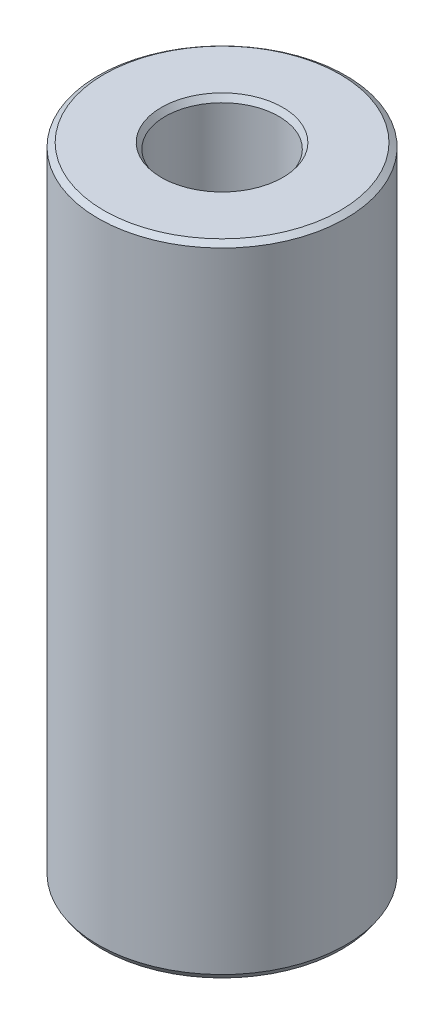
ISO-10303-21;
HEADER;
FILE_DESCRIPTION(('STEP AP214'),'2;1');
FILE_NAME('part.step','',(''),(''),'','','');
FILE_SCHEMA(('AUTOMOTIVE_DESIGN { 1 0 10303 214 1 1 1 1 }'));
ENDSEC;
DATA;
#1=APPLICATION_CONTEXT('core data for automotive mechanical design processes');
#2=APPLICATION_PROTOCOL_DEFINITION('international standard','automotive_design',2000,#1);
#3=PRODUCT_CONTEXT('',#1,'mechanical');
#4=PRODUCT('Part','Part','',(#3));
#5=PRODUCT_RELATED_PRODUCT_CATEGORY('part','',(#4));
#6=PRODUCT_DEFINITION_FORMATION('','',#4);
#7=PRODUCT_DEFINITION_CONTEXT('part definition',#1,'design');
#8=PRODUCT_DEFINITION('design','',#6,#7);
#9=PRODUCT_DEFINITION_SHAPE('','',#8);
#10=(LENGTH_UNIT() NAMED_UNIT(*) SI_UNIT(.MILLI.,.METRE.));
#11=(NAMED_UNIT(*) PLANE_ANGLE_UNIT() SI_UNIT($,.RADIAN.));
#12=(NAMED_UNIT(*) SI_UNIT($,.STERADIAN.) SOLID_ANGLE_UNIT());
#13=UNCERTAINTY_MEASURE_WITH_UNIT(LENGTH_MEASURE(1.E-05),#10,'distance_accuracy_value','');
#14=(GEOMETRIC_REPRESENTATION_CONTEXT(3) GLOBAL_UNCERTAINTY_ASSIGNED_CONTEXT((#13)) GLOBAL_UNIT_ASSIGNED_CONTEXT((#10,
#11,#12)) REPRESENTATION_CONTEXT('',''));
#15=CARTESIAN_POINT('',(0.,0.,0.));
#16=DIRECTION('',(0.,0.,1.));
#17=DIRECTION('',(1.,0.,0.));
#18=AXIS2_PLACEMENT_3D('',#15,#16,#17);
#19=CARTESIAN_POINT('',(0.,258.032303413777,0.));
#20=DIRECTION('',(0.,-1.,0.));
#21=DIRECTION('',(0.,0.,-1.));
#22=AXIS2_PLACEMENT_3D('',#19,#20,#21);
#23=CYLINDRICAL_SURFACE('',#22,50.);
#24=CARTESIAN_POINT('',(0.,2.32242210803651,0.));
#25=DIRECTION('',(0.,1.,0.));
#26=DIRECTION('',(0.,0.,1.));
#27=AXIS2_PLACEMENT_3D('',#24,#25,#26);
#28=CIRCLE('',#27,50.);
#29=CARTESIAN_POINT('',(0.,2.32242210803651,50.));
#30=VERTEX_POINT('',#29);
#31=EDGE_CURVE('E10',#30,#30,#28,.T.);
#32=ORIENTED_EDGE('',*,*,#31,.T.);
#33=EDGE_LOOP('',(#32));
#34=FACE_BOUND('',#33,.T.);
#35=CARTESIAN_POINT('',(0.,256.437061708535,0.));
#36=DIRECTION('',(0.,1.,0.));
#37=DIRECTION('',(0.,0.,1.));
#38=AXIS2_PLACEMENT_3D('',#35,#36,#37);
#39=CIRCLE('',#38,50.);
#40=CARTESIAN_POINT('',(0.,256.437061708535,50.));
#41=VERTEX_POINT('',#40);
#42=EDGE_CURVE('E50',#41,#41,#39,.F.);
#43=ORIENTED_EDGE('',*,*,#42,.T.);
#44=EDGE_LOOP('',(#43));
#45=FACE_BOUND('',#44,.T.);
#46=ADVANCED_FACE('F39',(#34,#45),#23,.T.);
#47=CARTESIAN_POINT('',(0.,258.032303413777,0.));
#48=DIRECTION('',(0.,1.,0.));
#49=DIRECTION('',(0.,0.,1.));
#50=AXIS2_PLACEMENT_3D('',#47,#48,#49);
#51=PLANE('',#50);
#52=CARTESIAN_POINT('',(0.,258.032303413777,0.));
#53=DIRECTION('',(0.,1.,0.));
#54=DIRECTION('',(0.,0.,1.));
#55=AXIS2_PLACEMENT_3D('',#52,#53,#54);
#56=CIRCLE('',#55,24.5317904876431);
#57=CARTESIAN_POINT('',(0.,258.032303413777,24.5317904876431));
#58=VERTEX_POINT('',#57);
#59=EDGE_CURVE('E58',#58,#58,#56,.F.);
#60=ORIENTED_EDGE('',*,*,#59,.T.);
#61=EDGE_LOOP('',(#60));
#62=FACE_BOUND('',#61,.T.);
#63=CARTESIAN_POINT('',(0.,258.032303413777,0.));
#64=DIRECTION('',(0.,1.,0.));
#65=DIRECTION('',(0.,0.,1.));
#66=AXIS2_PLACEMENT_3D('',#63,#64,#65);
#67=CIRCLE('',#66,47.6775778919636);
#68=CARTESIAN_POINT('',(0.,258.032303413777,47.6775778919636));
#69=VERTEX_POINT('',#68);
#70=EDGE_CURVE('E61',#69,#69,#67,.T.);
#71=ORIENTED_EDGE('',*,*,#70,.T.);
#72=EDGE_LOOP('',(#71));
#73=FACE_BOUND('',#72,.T.);
#74=ADVANCED_FACE('F88',(#62,#73),#51,.T.);
#75=CARTESIAN_POINT('',(0.,0.,0.));
#76=DIRECTION('',(0.,1.,0.));
#77=DIRECTION('',(0.,0.,1.));
#78=AXIS2_PLACEMENT_3D('',#75,#76,#77);
#79=PLANE('',#78);
#80=CARTESIAN_POINT('',(0.,0.,0.));
#81=DIRECTION('',(0.,1.,0.));
#82=DIRECTION('',(0.,0.,1.));
#83=AXIS2_PLACEMENT_3D('',#80,#81,#82);
#84=CIRCLE('',#83,25.2589708904378);
#85=CARTESIAN_POINT('',(0.,0.,25.2589708904378));
#86=VERTEX_POINT('',#85);
#87=EDGE_CURVE('E51',#86,#86,#84,.T.);
#88=ORIENTED_EDGE('',*,*,#87,.T.);
#89=EDGE_LOOP('',(#88));
#90=FACE_BOUND('',#89,.T.);
#91=CARTESIAN_POINT('',(0.,0.,0.));
#92=DIRECTION('',(0.,1.,0.));
#93=DIRECTION('',(0.,0.,1.));
#94=AXIS2_PLACEMENT_3D('',#91,#92,#93);
#95=CIRCLE('',#94,48.4047582947582);
#96=CARTESIAN_POINT('',(0.,0.,48.4047582947582));
#97=VERTEX_POINT('',#96);
#98=EDGE_CURVE('E54',#97,#97,#95,.F.);
#99=ORIENTED_EDGE('',*,*,#98,.T.);
#100=EDGE_LOOP('',(#99));
#101=FACE_BOUND('',#100,.T.);
#102=ADVANCED_FACE('F83',(#90,#101),#79,.F.);
#103=CARTESIAN_POINT('',(0.,258.032303413777,0.));
#104=DIRECTION('',(0.,-1.,0.));
#105=DIRECTION('',(0.,0.,-1.));
#106=AXIS2_PLACEMENT_3D('',#103,#104,#105);
#107=CYLINDRICAL_SURFACE('',#106,22.9365487824013);
#108=CARTESIAN_POINT('',(0.,255.70988130574,0.));
#109=DIRECTION('',(0.,1.,0.));
#110=DIRECTION('',(0.,0.,1.));
#111=AXIS2_PLACEMENT_3D('',#108,#109,#110);
#112=CIRCLE('',#111,22.9365487824013);
#113=CARTESIAN_POINT('',(0.,255.70988130574,22.9365487824013));
#114=VERTEX_POINT('',#113);
#115=EDGE_CURVE('E67',#114,#114,#112,.T.);
#116=ORIENTED_EDGE('',*,*,#115,.T.);
#117=EDGE_LOOP('',(#116));
#118=FACE_BOUND('',#117,.T.);
#119=CARTESIAN_POINT('',(0.,1.59524170524172,0.));
#120=DIRECTION('',(0.,1.,0.));
#121=DIRECTION('',(0.,0.,1.));
#122=AXIS2_PLACEMENT_3D('',#119,#120,#121);
#123=CIRCLE('',#122,22.9365487824013);
#124=CARTESIAN_POINT('',(0.,1.59524170524172,22.9365487824013));
#125=VERTEX_POINT('',#124);
#126=EDGE_CURVE('E69',#125,#125,#123,.F.);
#127=ORIENTED_EDGE('',*,*,#126,.T.);
#128=EDGE_LOOP('',(#127));
#129=FACE_BOUND('',#128,.T.);
#130=ADVANCED_FACE('F71',(#118,#129),#107,.F.);
#131=CARTESIAN_POINT('',(0.,255.70988130574,0.));
#132=DIRECTION('',(0.,1.,0.));
#133=DIRECTION('',(0.,0.,1.));
#134=AXIS2_PLACEMENT_3D('',#131,#132,#133);
#135=CONICAL_SURFACE('',#134,22.9365487824013,0.60187101645473);
#136=CARTESIAN_POINT('',(0.,258.032303413777,24.5317904876431));
#137=CARTESIAN_POINT('',(0.,258.008111516818,24.5151733865468));
#138=CARTESIAN_POINT('',(0.,257.983919619859,24.4985562854506));
#139=CARTESIAN_POINT('',(0.,257.935535825942,24.465322083258));
#140=CARTESIAN_POINT('',(0.,257.911343928983,24.4487049821618));
#141=CARTESIAN_POINT('',(0.,257.862960135066,24.4154707799692));
#142=CARTESIAN_POINT('',(0.,257.838768238107,24.3988536788729));
#143=CARTESIAN_POINT('',(0.,257.790384444189,24.3656194766804));
#144=CARTESIAN_POINT('',(0.,257.766192547231,24.3490023755841));
#145=CARTESIAN_POINT('',(0.,257.717808753313,24.3157681733916));
#146=CARTESIAN_POINT('',(0.,257.693616856355,24.2991510722953));
#147=CARTESIAN_POINT('',(0.,257.645233062437,24.2659168701028));
#148=CARTESIAN_POINT('',(0.,257.621041165479,24.2492997690065));
#149=CARTESIAN_POINT('',(0.,257.572657371561,24.216065566814));
#150=CARTESIAN_POINT('',(0.,257.548465474602,24.1994484657177));
#151=CARTESIAN_POINT('',(0.,257.500081680685,24.1662142635252));
#152=CARTESIAN_POINT('',(0.,257.475889783726,24.1495971624289));
#153=CARTESIAN_POINT('',(0.,257.427505989809,24.1163629602364));
#154=CARTESIAN_POINT('',(0.,257.40331409285,24.0997458591401));
#155=CARTESIAN_POINT('',(0.,257.354930298933,24.0665116569476));
#156=CARTESIAN_POINT('',(0.,257.330738401974,24.0498945558513));
#157=CARTESIAN_POINT('',(0.,257.282354608056,24.0166603536588));
#158=CARTESIAN_POINT('',(0.,257.258162711098,24.0000432525625));
#159=CARTESIAN_POINT('',(0.,257.20977891718,23.96680905037));
#160=CARTESIAN_POINT('',(0.,257.185587020222,23.9501919492737));
#161=CARTESIAN_POINT('',(0.,257.137203226304,23.9169577470812));
#162=CARTESIAN_POINT('',(0.,257.113011329346,23.9003406459849));
#163=CARTESIAN_POINT('',(0.,257.064627535428,23.8671064437924));
#164=CARTESIAN_POINT('',(0.,257.040435638469,23.8504893426961));
#165=CARTESIAN_POINT('',(0.,256.992051844552,23.8172551405035));
#166=CARTESIAN_POINT('',(0.,256.967859947593,23.8006380394073));
#167=CARTESIAN_POINT('',(0.,256.919476153676,23.7674038372147));
#168=CARTESIAN_POINT('',(0.,256.895284256717,23.7507867361185));
#169=CARTESIAN_POINT('',(0.,256.8469004628,23.7175525339259));
#170=CARTESIAN_POINT('',(0.,256.822708565841,23.7009354328297));
#171=CARTESIAN_POINT('',(0.,256.774324771923,23.6677012306371));
#172=CARTESIAN_POINT('',(0.,256.750132874965,23.6510841295409));
#173=CARTESIAN_POINT('',(0.,256.701749081047,23.6178499273483));
#174=CARTESIAN_POINT('',(0.,256.677557184089,23.6012328262521));
#175=CARTESIAN_POINT('',(0.,256.629173390171,23.5679986240595));
#176=CARTESIAN_POINT('',(0.,256.604981493213,23.5513815229632));
#177=CARTESIAN_POINT('',(0.,256.556597699295,23.5181473207707));
#178=CARTESIAN_POINT('',(0.,256.532405802336,23.5015302196744));
#179=CARTESIAN_POINT('',(0.,256.484022008419,23.4682960174819));
#180=CARTESIAN_POINT('',(0.,256.45983011146,23.4516789163856));
#181=CARTESIAN_POINT('',(0.,256.411446317543,23.4184447141931));
#182=CARTESIAN_POINT('',(0.,256.387254420584,23.4018276130968));
#183=CARTESIAN_POINT('',(0.,256.338870626667,23.3685934109043));
#184=CARTESIAN_POINT('',(0.,256.314678729708,23.351976309808));
#185=CARTESIAN_POINT('',(0.,256.26629493579,23.3187421076155));
#186=CARTESIAN_POINT('',(0.,256.242103038832,23.3021250065192));
#187=CARTESIAN_POINT('',(0.,256.193719244914,23.2688908043267));
#188=CARTESIAN_POINT('',(0.,256.169527347956,23.2522737032304));
#189=CARTESIAN_POINT('',(0.,256.121143554038,23.2190395010379));
#190=CARTESIAN_POINT('',(0.,256.09695165708,23.2024223999416));
#191=CARTESIAN_POINT('',(0.,256.048567863162,23.1691881977491));
#192=CARTESIAN_POINT('',(0.,256.024375966203,23.1525710966528));
#193=CARTESIAN_POINT('',(0.,255.975992172286,23.1193368944603));
#194=CARTESIAN_POINT('',(0.,255.951800275327,23.102719793364));
#195=CARTESIAN_POINT('',(0.,255.90341648141,23.0694855911715));
#196=CARTESIAN_POINT('',(0.,255.879224584451,23.0528684900752));
#197=CARTESIAN_POINT('',(0.,255.830840790534,23.0196342878827));
#198=CARTESIAN_POINT('',(0.,255.806648893575,23.0030171867864));
#199=CARTESIAN_POINT('',(0.,255.758265099658,22.9697829845939));
#200=CARTESIAN_POINT('',(0.,255.734073202699,22.9531658834976));
#201=CARTESIAN_POINT('',(0.,255.70988130574,22.9365487824013));
#202=B_SPLINE_CURVE_WITH_KNOTS('',3,(#136,#137,#138,#139,#140,#141,#142,#143,#144,#145,#146,
#147,#148,#149,#150,#151,#152,#153,#154,#155,#156,#157,#158,#159,#160,#161,#162,#163,#164,#165,
#166,#167,#168,#169,#170,#171,#172,#173,#174,#175,#176,#177,#178,#179,#180,#181,#182,#183,#184,
#185,#186,#187,#188,#189,#190,#191,#192,#193,#194,#195,#196,#197,#198,#199,#200,#201),
.UNSPECIFIED.,.F.,.F.,(4,2,2,2,2,2,2,2,2,2,2,2,2,2,2,2,2,2,2,2,2,2,2,2,2,2,2,2,2,2,2,2,4),(0.,
0.0880476197619425,0.176095239523883,0.264142859285825,0.352190479047768,0.440238098809663,
0.528285718571605,0.616333338333546,0.704380958095488,0.792428577857429,0.880476197619325,
0.968523817381268,1.05657143714321,1.14461905690515,1.23266667666705,1.32071429642899,
1.40876191619093,1.49680953595287,1.58485715571481,1.67290477547671,1.76095239523865,
1.84900001500059,1.93704763476253,2.02509525452443,2.11314287428637,2.20119049404831,
2.28923811381025,2.3772857335722,2.46533335333409,2.55338097309603,2.64142859285798,
2.72947621261992,2.81752383238181),.UNSPECIFIED.);
#203=EDGE_CURVE('BSEAM77',#58,#114,#202,.T.);
#204=ORIENTED_EDGE('',*,*,#59,.F.);
#205=ORIENTED_EDGE('',*,*,#115,.F.);
#206=ORIENTED_EDGE('',*,*,#203,.T.);
#207=ORIENTED_EDGE('',*,*,#203,.F.);
#208=EDGE_LOOP('',(#204,#206,#205,#207));
#209=FACE_BOUND('',#208,.T.);
#210=ADVANCED_FACE('F77',(#209),#135,.F.);
#211=CARTESIAN_POINT('',(0.,0.,0.));
#212=DIRECTION('',(0.,-1.,0.));
#213=DIRECTION('',(0.,0.,-1.));
#214=AXIS2_PLACEMENT_3D('',#211,#212,#213);
#215=CONICAL_SURFACE('',#214,25.2589708904378,0.96892531034017);
#216=ORIENTED_EDGE('',*,*,#126,.F.);
#217=EDGE_LOOP('',(#216));
#218=FACE_BOUND('',#217,.T.);
#219=ORIENTED_EDGE('',*,*,#87,.F.);
#220=EDGE_LOOP('',(#219));
#221=FACE_BOUND('',#220,.T.);
#222=ADVANCED_FACE('F73',(#218,#221),#215,.F.);
#223=CARTESIAN_POINT('',(0.,2.32242210803651,0.));
#224=DIRECTION('',(0.,1.,0.));
#225=DIRECTION('',(0.,0.,1.));
#226=AXIS2_PLACEMENT_3D('',#223,#224,#225);
#227=CONICAL_SURFACE('',#226,50.,0.601871016454732);
#228=CARTESIAN_POINT('',(0.,0.,48.4047582947582));
#229=CARTESIAN_POINT('',(0.,0.024191896958714,48.4213753958545));
#230=CARTESIAN_POINT('',(0.,0.0483837939174273,48.4379924969507));
#231=CARTESIAN_POINT('',(0.,0.096767587834854,48.4712266991433));
#232=CARTESIAN_POINT('',(0.,0.120959484793567,48.4878438002396));
#233=CARTESIAN_POINT('',(0.,0.169343278710995,48.5210780024321));
#234=CARTESIAN_POINT('',(0.,0.19353517566971,48.5376951035284));
#235=CARTESIAN_POINT('',(0.,0.241918969587137,48.5709293057209));
#236=CARTESIAN_POINT('',(0.,0.26611086654585,48.5875464068172));
#237=CARTESIAN_POINT('',(0.,0.314494660463277,48.6207806090097));
#238=CARTESIAN_POINT('',(0.,0.338686557421991,48.637397710106));
#239=CARTESIAN_POINT('',(0.,0.387070351339419,48.6706319122985));
#240=CARTESIAN_POINT('',(0.,0.411262248298132,48.6872490133948));
#241=CARTESIAN_POINT('',(0.,0.459646042215559,48.7204832155873));
#242=CARTESIAN_POINT('',(0.,0.483837939174273,48.7371003166836));
#243=CARTESIAN_POINT('',(0.,0.5322217330917,48.7703345188761));
#244=CARTESIAN_POINT('',(0.,0.556413630050415,48.7869516199724));
#245=CARTESIAN_POINT('',(0.,0.604797423967842,48.8201858221649));
#246=CARTESIAN_POINT('',(0.,0.628989320926556,48.8368029232612));
#247=CARTESIAN_POINT('',(0.,0.677373114843983,48.8700371254537));
#248=CARTESIAN_POINT('',(0.,0.701565011802696,48.88665422655));
#249=CARTESIAN_POINT('',(0.,0.749948805720124,48.9198884287425));
#250=CARTESIAN_POINT('',(0.,0.774140702678838,48.9365055298388));
#251=CARTESIAN_POINT('',(0.,0.822524496596265,48.9697397320313));
#252=CARTESIAN_POINT('',(0.,0.846716393554978,48.9863568331276));
#253=CARTESIAN_POINT('',(0.,0.895100187472406,49.0195910353202));
#254=CARTESIAN_POINT('',(0.,0.91929208443112,49.0362081364164));
#255=CARTESIAN_POINT('',(0.,0.967675878348548,49.069442338609));
#256=CARTESIAN_POINT('',(0.,0.991867775307261,49.0860594397052));
#257=CARTESIAN_POINT('',(0.,1.04025156922469,49.1192936418978));
#258=CARTESIAN_POINT('',(0.,1.0644434661834,49.135910742994));
#259=CARTESIAN_POINT('',(0.,1.11282726010083,49.1691449451866));
#260=CARTESIAN_POINT('',(0.,1.13701915705954,49.1857620462828));
#261=CARTESIAN_POINT('',(0.,1.18540295097697,49.2189962484754));
#262=CARTESIAN_POINT('',(0.,1.20959484793568,49.2356133495716));
#263=CARTESIAN_POINT('',(0.,1.25797864185311,49.2688475517642));
#264=CARTESIAN_POINT('',(0.,1.28217053881182,49.2854646528605));
#265=CARTESIAN_POINT('',(0.,1.33055433272925,49.318698855053));
#266=CARTESIAN_POINT('',(0.,1.35474622968797,49.3353159561493));
#267=CARTESIAN_POINT('',(0.,1.40313002360539,49.3685501583418));
#268=CARTESIAN_POINT('',(0.,1.42732192056411,49.3851672594381));
#269=CARTESIAN_POINT('',(0.,1.47570571448153,49.4184014616306));
#270=CARTESIAN_POINT('',(0.,1.49989761144025,49.4350185627269));
#271=CARTESIAN_POINT('',(0.,1.54828140535768,49.4682527649194));
#272=CARTESIAN_POINT('',(0.,1.57247330231639,49.4848698660157));
#273=CARTESIAN_POINT('',(0.,1.62085709623382,49.5181040682082));
#274=CARTESIAN_POINT('',(0.,1.64504899319253,49.5347211693045));
#275=CARTESIAN_POINT('',(0.,1.69343278710996,49.567955371497));
#276=CARTESIAN_POINT('',(0.,1.71762468406867,49.5845724725933));
#277=CARTESIAN_POINT('',(0.,1.7660084779861,49.6178066747858));
#278=CARTESIAN_POINT('',(0.,1.79020037494481,49.6344237758821));
#279=CARTESIAN_POINT('',(0.,1.83858416886224,49.6676579780746));
#280=CARTESIAN_POINT('',(0.,1.86277606582095,49.6842750791709));
#281=CARTESIAN_POINT('',(0.,1.91115985973838,49.7175092813634));
#282=CARTESIAN_POINT('',(0.,1.9353517566971,49.7341263824597));
#283=CARTESIAN_POINT('',(0.,1.98373555061452,49.7673605846522));
#284=CARTESIAN_POINT('',(0.,2.00792744757324,49.7839776857485));
#285=CARTESIAN_POINT('',(0.,2.05631124149066,49.817211887941));
#286=CARTESIAN_POINT('',(0.,2.08050313844938,49.8338289890373));
#287=CARTESIAN_POINT('',(0.,2.1288869323668,49.8670631912299));
#288=CARTESIAN_POINT('',(0.,2.15307882932552,49.8836802923261));
#289=CARTESIAN_POINT('',(0.,2.20146262324295,49.9169144945187));
#290=CARTESIAN_POINT('',(0.,2.22565452020166,49.9335315956149));
#291=CARTESIAN_POINT('',(0.,2.27403831411909,49.9667657978075));
#292=CARTESIAN_POINT('',(0.,2.2982302110778,49.9833828989037));
#293=CARTESIAN_POINT('',(0.,2.32242210803651,50.));
#294=B_SPLINE_CURVE_WITH_KNOTS('',3,(#228,#229,#230,#231,#232,#233,#234,#235,#236,#237,#238,
#239,#240,#241,#242,#243,#244,#245,#246,#247,#248,#249,#250,#251,#252,#253,#254,#255,#256,#257,
#258,#259,#260,#261,#262,#263,#264,#265,#266,#267,#268,#269,#270,#271,#272,#273,#274,#275,#276,
#277,#278,#279,#280,#281,#282,#283,#284,#285,#286,#287,#288,#289,#290,#291,#292,#293),
.UNSPECIFIED.,.F.,.F.,(4,2,2,2,2,2,2,2,2,2,2,2,2,2,2,2,2,2,2,2,2,2,2,2,2,2,2,2,2,2,2,2,4),(0.,
0.0880476197619325,0.176095239523865,0.264142859285794,0.352190479047726,0.440238098809658,
0.528285718571591,0.616333338333523,0.704380958095452,0.792428577857384,0.880476197619317,
0.968523817381249,1.05657143714318,1.14461905690511,1.23266667666704,1.32071429642898,
1.40876191619091,1.49680953595284,1.58485715571477,1.6729047754767,1.76095239523863,
1.84900001500057,1.9370476347625,2.02509525452443,2.11314287428636,2.20119049404829,
2.28923811381022,2.37728573357216,2.46533335333409,2.55338097309602,2.64142859285795,
2.72947621261988,2.81752383238181),.UNSPECIFIED.);
#295=EDGE_CURVE('BSEAM76',#97,#30,#294,.T.);
#296=ORIENTED_EDGE('',*,*,#98,.F.);
#297=ORIENTED_EDGE('',*,*,#31,.F.);
#298=ORIENTED_EDGE('',*,*,#295,.T.);
#299=ORIENTED_EDGE('',*,*,#295,.F.);
#300=EDGE_LOOP('',(#296,#298,#297,#299));
#301=FACE_BOUND('',#300,.T.);
#302=ADVANCED_FACE('F76',(#301),#227,.T.);
#303=CARTESIAN_POINT('',(0.,258.032303413777,0.));
#304=DIRECTION('',(0.,-1.,0.));
#305=DIRECTION('',(0.,0.,-1.));
#306=AXIS2_PLACEMENT_3D('',#303,#304,#305);
#307=CONICAL_SURFACE('',#306,47.6775778919636,0.96892531034016);
#308=ORIENTED_EDGE('',*,*,#42,.F.);
#309=EDGE_LOOP('',(#308));
#310=FACE_BOUND('',#309,.T.);
#311=ORIENTED_EDGE('',*,*,#70,.F.);
#312=EDGE_LOOP('',(#311));
#313=FACE_BOUND('',#312,.T.);
#314=ADVANCED_FACE('F45',(#310,#313),#307,.T.);
#315=CLOSED_SHELL('',(#46,#74,#102,#130,#210,#222,#302,#314));
#316=MANIFOLD_SOLID_BREP('B2',#315);
#317=ADVANCED_BREP_SHAPE_REPRESENTATION('',(#18,#316),#14);
#318=SHAPE_DEFINITION_REPRESENTATION(#9,#317);
ENDSEC;
END-ISO-10303-21;
